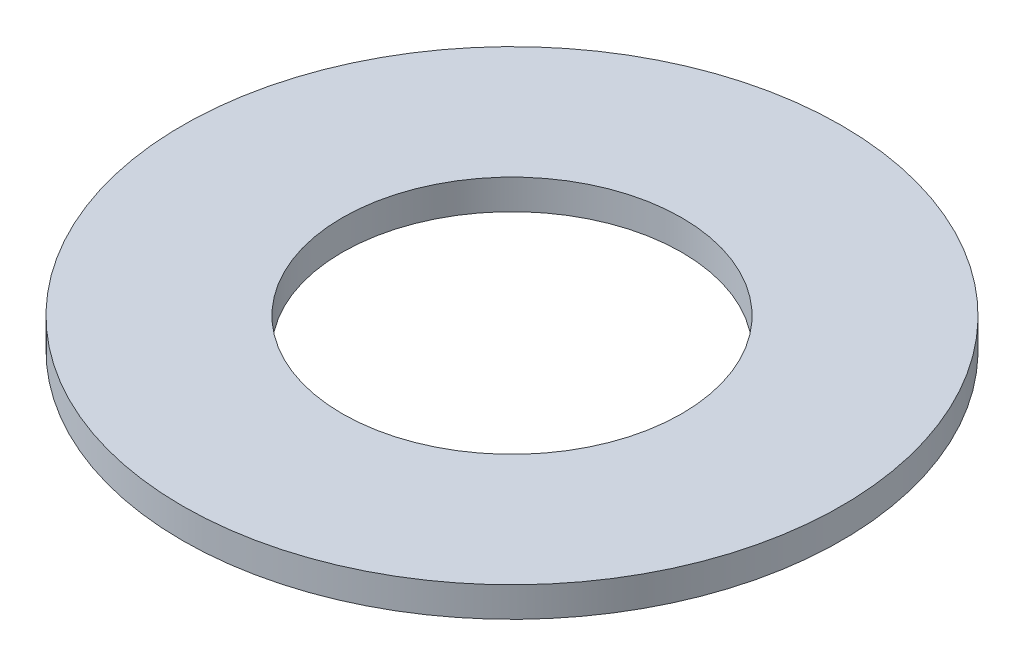
ISO-10303-21;
HEADER;
FILE_DESCRIPTION(('STEP AP214'),'2;1');
FILE_NAME('part.step','',(''),(''),'','','');
FILE_SCHEMA(('AUTOMOTIVE_DESIGN { 1 0 10303 214 1 1 1 1 }'));
ENDSEC;
DATA;
#1=APPLICATION_CONTEXT('core data for automotive mechanical design processes');
#2=APPLICATION_PROTOCOL_DEFINITION('international standard','automotive_design',2000,#1);
#3=PRODUCT_CONTEXT('',#1,'mechanical');
#4=PRODUCT('Part','Part','',(#3));
#5=PRODUCT_RELATED_PRODUCT_CATEGORY('part','',(#4));
#6=PRODUCT_DEFINITION_FORMATION('','',#4);
#7=PRODUCT_DEFINITION_CONTEXT('part definition',#1,'design');
#8=PRODUCT_DEFINITION('design','',#6,#7);
#9=PRODUCT_DEFINITION_SHAPE('','',#8);
#10=(LENGTH_UNIT() NAMED_UNIT(*) SI_UNIT(.MILLI.,.METRE.));
#11=(NAMED_UNIT(*) PLANE_ANGLE_UNIT() SI_UNIT($,.RADIAN.));
#12=(NAMED_UNIT(*) SI_UNIT($,.STERADIAN.) SOLID_ANGLE_UNIT());
#13=UNCERTAINTY_MEASURE_WITH_UNIT(LENGTH_MEASURE(1.E-05),#10,'distance_accuracy_value','');
#14=(GEOMETRIC_REPRESENTATION_CONTEXT(3) GLOBAL_UNCERTAINTY_ASSIGNED_CONTEXT((#13)) GLOBAL_UNIT_ASSIGNED_CONTEXT((#10,
#11,#12)) REPRESENTATION_CONTEXT('',''));
#15=CARTESIAN_POINT('',(0.,0.,0.));
#16=DIRECTION('',(0.,0.,1.));
#17=DIRECTION('',(1.,0.,0.));
#18=AXIS2_PLACEMENT_3D('',#15,#16,#17);
#19=CARTESIAN_POINT('',(0.,0.,0.));
#20=DIRECTION('',(0.,-1.,0.));
#21=DIRECTION('',(0.,0.,-1.));
#22=AXIS2_PLACEMENT_3D('',#19,#20,#21);
#23=CYLINDRICAL_SURFACE('',#22,8.5);
#24=CARTESIAN_POINT('',(0.,0.,0.));
#25=DIRECTION('',(0.,-1.,0.));
#26=DIRECTION('',(0.,0.,-1.));
#27=AXIS2_PLACEMENT_3D('',#24,#25,#26);
#28=CIRCLE('',#27,8.5);
#29=CARTESIAN_POINT('',(0.,0.,-8.5));
#30=VERTEX_POINT('',#29);
#31=EDGE_CURVE('E55',#30,#30,#28,.T.);
#32=ORIENTED_EDGE('',*,*,#31,.T.);
#33=EDGE_LOOP('',(#32));
#34=FACE_BOUND('',#33,.T.);
#35=CARTESIAN_POINT('',(0.,1.5,0.));
#36=DIRECTION('',(0.,-1.,0.));
#37=DIRECTION('',(0.,0.,-1.));
#38=AXIS2_PLACEMENT_3D('',#35,#36,#37);
#39=CIRCLE('',#38,8.5);
#40=CARTESIAN_POINT('',(0.,1.5,-8.5));
#41=VERTEX_POINT('',#40);
#42=EDGE_CURVE('E10',#41,#41,#39,.T.);
#43=ORIENTED_EDGE('',*,*,#42,.F.);
#44=EDGE_LOOP('',(#43));
#45=FACE_BOUND('',#44,.T.);
#46=ADVANCED_FACE('F41',(#34,#45),#23,.F.);
#47=CARTESIAN_POINT('',(0.,1.5,-8.5));
#48=DIRECTION('',(0.,1.,0.));
#49=DIRECTION('',(0.,0.,1.));
#50=AXIS2_PLACEMENT_3D('',#47,#48,#49);
#51=PLANE('',#50);
#52=ORIENTED_EDGE('',*,*,#42,.T.);
#53=EDGE_LOOP('',(#52));
#54=FACE_BOUND('',#53,.T.);
#55=CARTESIAN_POINT('',(0.,1.5,0.));
#56=DIRECTION('',(0.,-1.,0.));
#57=DIRECTION('',(0.,0.,-1.));
#58=AXIS2_PLACEMENT_3D('',#55,#56,#57);
#59=CIRCLE('',#58,16.5);
#60=CARTESIAN_POINT('',(0.,1.5,-16.5));
#61=VERTEX_POINT('',#60);
#62=EDGE_CURVE('E47',#61,#61,#59,.T.);
#63=ORIENTED_EDGE('',*,*,#62,.F.);
#64=EDGE_LOOP('',(#63));
#65=FACE_BOUND('',#64,.T.);
#66=ADVANCED_FACE('F71',(#54,#65),#51,.T.);
#67=CARTESIAN_POINT('',(0.,0.,0.));
#68=DIRECTION('',(0.,-1.,0.));
#69=DIRECTION('',(0.,0.,-1.));
#70=AXIS2_PLACEMENT_3D('',#67,#68,#69);
#71=CYLINDRICAL_SURFACE('',#70,16.5);
#72=ORIENTED_EDGE('',*,*,#62,.T.);
#73=EDGE_LOOP('',(#72));
#74=FACE_BOUND('',#73,.T.);
#75=CARTESIAN_POINT('',(0.,0.,0.));
#76=DIRECTION('',(0.,-1.,0.));
#77=DIRECTION('',(0.,0.,-1.));
#78=AXIS2_PLACEMENT_3D('',#75,#76,#77);
#79=CIRCLE('',#78,16.5);
#80=CARTESIAN_POINT('',(0.,0.,-16.5));
#81=VERTEX_POINT('',#80);
#82=EDGE_CURVE('E51',#81,#81,#79,.T.);
#83=ORIENTED_EDGE('',*,*,#82,.F.);
#84=EDGE_LOOP('',(#83));
#85=FACE_BOUND('',#84,.T.);
#86=ADVANCED_FACE('F65',(#74,#85),#71,.T.);
#87=CARTESIAN_POINT('',(0.,0.,-8.5));
#88=DIRECTION('',(0.,-1.,0.));
#89=DIRECTION('',(0.,0.,-1.));
#90=AXIS2_PLACEMENT_3D('',#87,#88,#89);
#91=PLANE('',#90);
#92=ORIENTED_EDGE('',*,*,#82,.T.);
#93=EDGE_LOOP('',(#92));
#94=FACE_BOUND('',#93,.T.);
#95=ORIENTED_EDGE('',*,*,#31,.F.);
#96=EDGE_LOOP('',(#95));
#97=FACE_BOUND('',#96,.T.);
#98=ADVANCED_FACE('F63',(#94,#97),#91,.T.);
#99=CLOSED_SHELL('',(#46,#66,#86,#98));
#100=MANIFOLD_SOLID_BREP('B2',#99);
#101=ADVANCED_BREP_SHAPE_REPRESENTATION('',(#18,#100),#14);
#102=SHAPE_DEFINITION_REPRESENTATION(#9,#101);
ENDSEC;
END-ISO-10303-21;
